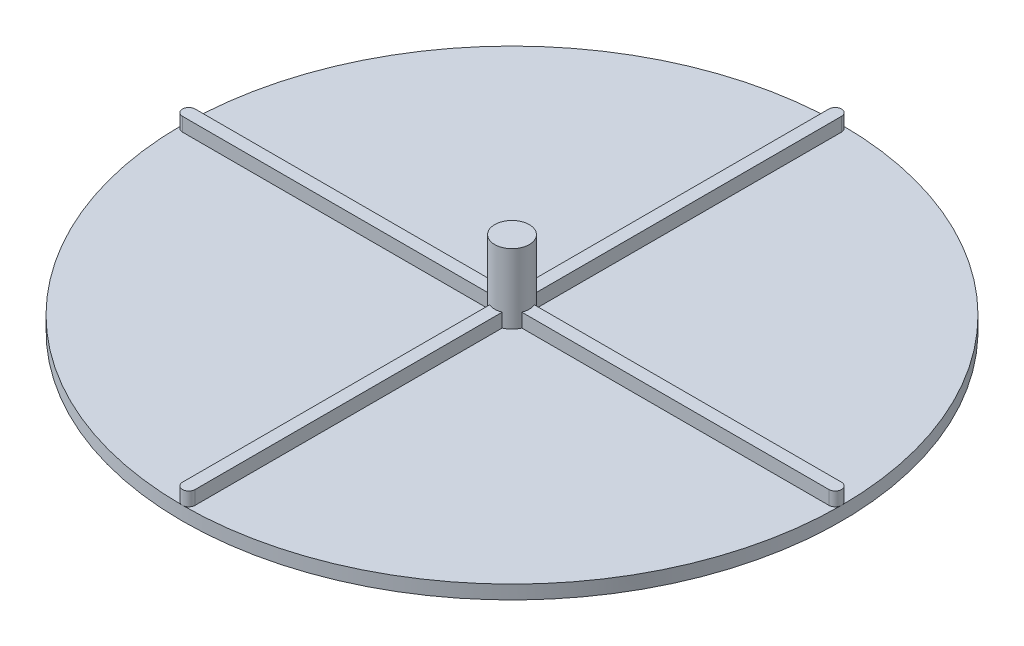
ISO-10303-21;
HEADER;
FILE_DESCRIPTION(('STEP AP214'),'2;1');
FILE_NAME('part.step','',(''),(''),'','','');
FILE_SCHEMA(('AUTOMOTIVE_DESIGN { 1 0 10303 214 1 1 1 1 }'));
ENDSEC;
DATA;
#1=APPLICATION_CONTEXT('core data for automotive mechanical design processes');
#2=APPLICATION_PROTOCOL_DEFINITION('international standard','automotive_design',2000,#1);
#3=PRODUCT_CONTEXT('',#1,'mechanical');
#4=PRODUCT('Part','Part','',(#3));
#5=PRODUCT_RELATED_PRODUCT_CATEGORY('part','',(#4));
#6=PRODUCT_DEFINITION_FORMATION('','',#4);
#7=PRODUCT_DEFINITION_CONTEXT('part definition',#1,'design');
#8=PRODUCT_DEFINITION('design','',#6,#7);
#9=PRODUCT_DEFINITION_SHAPE('','',#8);
#10=(LENGTH_UNIT() NAMED_UNIT(*) SI_UNIT(.MILLI.,.METRE.));
#11=(NAMED_UNIT(*) PLANE_ANGLE_UNIT() SI_UNIT($,.RADIAN.));
#12=(NAMED_UNIT(*) SI_UNIT($,.STERADIAN.) SOLID_ANGLE_UNIT());
#13=UNCERTAINTY_MEASURE_WITH_UNIT(LENGTH_MEASURE(1.E-05),#10,'distance_accuracy_value','');
#14=(GEOMETRIC_REPRESENTATION_CONTEXT(3) GLOBAL_UNCERTAINTY_ASSIGNED_CONTEXT((#13)) GLOBAL_UNIT_ASSIGNED_CONTEXT((#10,
#11,#12)) REPRESENTATION_CONTEXT('',''));
#15=CARTESIAN_POINT('',(0.,0.,0.));
#16=DIRECTION('',(0.,0.,1.));
#17=DIRECTION('',(1.,0.,0.));
#18=AXIS2_PLACEMENT_3D('',#15,#16,#17);
#19=CARTESIAN_POINT('',(0.,6.35,-74.7395));
#20=DIRECTION('',(0.,1.,0.));
#21=DIRECTION('',(0.,0.,1.));
#22=AXIS2_PLACEMENT_3D('',#19,#20,#21);
#23=PLANE('',#22);
#24=CARTESIAN_POINT('',(0.,6.35,0.));
#25=DIRECTION('',(0.,1.,0.));
#26=DIRECTION('',(0.,0.,1.));
#27=AXIS2_PLACEMENT_3D('',#24,#25,#26);
#28=CIRCLE('',#27,4.);
#29=CARTESIAN_POINT('',(3.72383401214393,6.35,1.4605));
#30=VERTEX_POINT('',#29);
#31=CARTESIAN_POINT('',(3.72383401214393,6.35,-1.4605));
#32=VERTEX_POINT('',#31);
#33=EDGE_CURVE('E222',#30,#32,#28,.T.);
#34=ORIENTED_EDGE('',*,*,#33,.F.);
#35=DIRECTION('',(1.,0.,0.));
#36=VECTOR('',#35,1.);
#37=CARTESIAN_POINT('',(-74.7395,6.35,1.4605));
#38=LINE('',#37,#36);
#39=CARTESIAN_POINT('',(74.7395,6.35,1.4605));
#40=VERTEX_POINT('',#39);
#41=EDGE_CURVE('E324',#30,#40,#38,.T.);
#42=ORIENTED_EDGE('',*,*,#41,.T.);
#43=CARTESIAN_POINT('',(74.7395,6.35,0.));
#44=DIRECTION('',(0.,1.,0.));
#45=DIRECTION('',(0.,0.,1.));
#46=AXIS2_PLACEMENT_3D('',#43,#44,#45);
#47=CIRCLE('',#46,1.4605);
#48=CARTESIAN_POINT('',(74.7395,6.35,-1.4605));
#49=VERTEX_POINT('',#48);
#50=EDGE_CURVE('E317',#40,#49,#47,.T.);
#51=ORIENTED_EDGE('',*,*,#50,.T.);
#52=DIRECTION('',(1.,0.,0.));
#53=VECTOR('',#52,1.);
#54=CARTESIAN_POINT('',(-74.7395,6.35,-1.4605));
#55=LINE('',#54,#53);
#56=EDGE_CURVE('E207',#32,#49,#55,.T.);
#57=ORIENTED_EDGE('',*,*,#56,.F.);
#58=EDGE_LOOP('',(#34,#42,#51,#57));
#59=FACE_BOUND('',#58,.T.);
#60=ADVANCED_FACE('F69',(#59),#23,.T.);
#61=CARTESIAN_POINT('',(1.46050000000002,6.35,-3.72383401214393));
#62=VERTEX_POINT('',#61);
#63=CARTESIAN_POINT('',(-1.46049999999998,6.35,-3.72383401214394));
#64=VERTEX_POINT('',#63);
#65=EDGE_CURVE('E221',#62,#64,#28,.T.);
#66=ORIENTED_EDGE('',*,*,#65,.F.);
#67=DIRECTION('',(0.,0.,1.));
#68=VECTOR('',#67,1.);
#69=CARTESIAN_POINT('',(1.46050000000002,6.35,-74.7395));
#70=LINE('',#69,#68);
#71=CARTESIAN_POINT('',(1.46050000000002,6.35,-74.7395));
#72=VERTEX_POINT('',#71);
#73=EDGE_CURVE('E277',#72,#62,#70,.T.);
#74=ORIENTED_EDGE('',*,*,#73,.F.);
#75=CARTESIAN_POINT('',(0.,6.35,-74.7395));
#76=DIRECTION('',(0.,1.,0.));
#77=DIRECTION('',(0.,0.,1.));
#78=AXIS2_PLACEMENT_3D('',#75,#76,#77);
#79=CIRCLE('',#78,1.4605);
#80=CARTESIAN_POINT('',(-1.46049999999998,6.35,-74.7395));
#81=VERTEX_POINT('',#80);
#82=EDGE_CURVE('E262',#72,#81,#79,.T.);
#83=ORIENTED_EDGE('',*,*,#82,.T.);
#84=DIRECTION('',(0.,0.,1.));
#85=VECTOR('',#84,1.);
#86=CARTESIAN_POINT('',(-1.46049999999998,6.35,-74.7395));
#87=LINE('',#86,#85);
#88=EDGE_CURVE('E268',#81,#64,#87,.T.);
#89=ORIENTED_EDGE('',*,*,#88,.T.);
#90=EDGE_LOOP('',(#66,#74,#83,#89));
#91=FACE_BOUND('',#90,.T.);
#92=ADVANCED_FACE('F456',(#91),#23,.T.);
#93=CARTESIAN_POINT('',(-3.72383401214394,6.35,-1.4605));
#94=VERTEX_POINT('',#93);
#95=CARTESIAN_POINT('',(-3.72383401214393,6.35,1.4605));
#96=VERTEX_POINT('',#95);
#97=EDGE_CURVE('E211',#94,#96,#28,.T.);
#98=ORIENTED_EDGE('',*,*,#97,.F.);
#99=CARTESIAN_POINT('',(-74.7395,6.35,-1.4605));
#100=VERTEX_POINT('',#99);
#101=EDGE_CURVE('E196',#100,#94,#55,.T.);
#102=ORIENTED_EDGE('',*,*,#101,.F.);
#103=CARTESIAN_POINT('',(-74.7395,6.35,0.));
#104=DIRECTION('',(0.,1.,0.));
#105=DIRECTION('',(0.,0.,1.));
#106=AXIS2_PLACEMENT_3D('',#103,#104,#105);
#107=CIRCLE('',#106,1.4605);
#108=CARTESIAN_POINT('',(-74.7395,6.35,1.4605));
#109=VERTEX_POINT('',#108);
#110=EDGE_CURVE('E206',#100,#109,#107,.T.);
#111=ORIENTED_EDGE('',*,*,#110,.T.);
#112=EDGE_CURVE('E214',#109,#96,#38,.T.);
#113=ORIENTED_EDGE('',*,*,#112,.T.);
#114=EDGE_LOOP('',(#98,#102,#111,#113));
#115=FACE_BOUND('',#114,.T.);
#116=ADVANCED_FACE('F212',(#115),#23,.T.);
#117=CARTESIAN_POINT('',(0.,3.175,0.));
#118=DIRECTION('',(0.,1.,0.));
#119=DIRECTION('',(0.,0.,1.));
#120=AXIS2_PLACEMENT_3D('',#117,#118,#119);
#121=PLANE('',#120);
#122=CARTESIAN_POINT('',(0.,3.175,0.));
#123=DIRECTION('',(0.,1.,0.));
#124=DIRECTION('',(0.,0.,1.));
#125=AXIS2_PLACEMENT_3D('',#122,#123,#124);
#126=CIRCLE('',#125,4.);
#127=CARTESIAN_POINT('',(3.72383401214393,3.175,1.4605));
#128=VERTEX_POINT('',#127);
#129=CARTESIAN_POINT('',(1.46050000000002,3.175,3.72383401214393));
#130=VERTEX_POINT('',#129);
#131=EDGE_CURVE('E93',#128,#130,#126,.F.);
#132=ORIENTED_EDGE('',*,*,#131,.T.);
#133=DIRECTION('',(0.,0.,1.));
#134=VECTOR('',#133,1.);
#135=CARTESIAN_POINT('',(1.46050000000002,3.175,-74.7395));
#136=LINE('',#135,#134);
#137=CARTESIAN_POINT('',(1.46050000000002,3.175,74.7395));
#138=VERTEX_POINT('',#137);
#139=EDGE_CURVE('E296',#130,#138,#136,.T.);
#140=ORIENTED_EDGE('',*,*,#139,.T.);
#141=CARTESIAN_POINT('',(0.,3.175,74.7395));
#142=DIRECTION('',(0.,1.,0.));
#143=DIRECTION('',(0.,0.,1.));
#144=AXIS2_PLACEMENT_3D('',#141,#142,#143);
#145=CIRCLE('',#144,1.4605);
#146=CARTESIAN_POINT('',(0.,3.175,76.2));
#147=VERTEX_POINT('',#146);
#148=EDGE_CURVE('E297',#147,#138,#145,.T.);
#149=ORIENTED_EDGE('',*,*,#148,.F.);
#150=CARTESIAN_POINT('',(0.,3.175,0.));
#151=DIRECTION('',(0.,1.,0.));
#152=DIRECTION('',(0.,0.,1.));
#153=AXIS2_PLACEMENT_3D('',#150,#151,#152);
#154=CIRCLE('',#153,76.2);
#155=CARTESIAN_POINT('',(76.2,3.175,0.));
#156=VERTEX_POINT('',#155);
#157=EDGE_CURVE('E356',#147,#156,#154,.T.);
#158=ORIENTED_EDGE('',*,*,#157,.T.);
#159=CARTESIAN_POINT('',(74.7395,3.175,0.));
#160=DIRECTION('',(0.,1.,0.));
#161=DIRECTION('',(0.,0.,1.));
#162=AXIS2_PLACEMENT_3D('',#159,#160,#161);
#163=CIRCLE('',#162,1.4605);
#164=CARTESIAN_POINT('',(74.7395,3.175,1.4605));
#165=VERTEX_POINT('',#164);
#166=EDGE_CURVE('E261',#165,#156,#163,.T.);
#167=ORIENTED_EDGE('',*,*,#166,.F.);
#168=DIRECTION('',(1.,0.,0.));
#169=VECTOR('',#168,1.);
#170=CARTESIAN_POINT('',(-74.7395,3.175,1.4605));
#171=LINE('',#170,#169);
#172=EDGE_CURVE('E339',#128,#165,#171,.T.);
#173=ORIENTED_EDGE('',*,*,#172,.F.);
#174=EDGE_LOOP('',(#132,#140,#149,#158,#167,#173));
#175=FACE_BOUND('',#174,.T.);
#176=ADVANCED_FACE('F444',(#175),#121,.T.);
#177=CARTESIAN_POINT('',(1.46050000000002,3.175,-3.72383401214393));
#178=VERTEX_POINT('',#177);
#179=CARTESIAN_POINT('',(3.72383401214393,3.175,-1.4605));
#180=VERTEX_POINT('',#179);
#181=EDGE_CURVE('E232',#178,#180,#126,.F.);
#182=ORIENTED_EDGE('',*,*,#181,.T.);
#183=DIRECTION('',(1.,0.,0.));
#184=VECTOR('',#183,1.);
#185=CARTESIAN_POINT('',(-74.7395,3.175,-1.4605));
#186=LINE('',#185,#184);
#187=CARTESIAN_POINT('',(74.7395,3.175,-1.4605));
#188=VERTEX_POINT('',#187);
#189=EDGE_CURVE('E331',#180,#188,#186,.T.);
#190=ORIENTED_EDGE('',*,*,#189,.T.);
#191=EDGE_CURVE('E78',#156,#188,#163,.T.);
#192=ORIENTED_EDGE('',*,*,#191,.F.);
#193=CARTESIAN_POINT('',(0.,3.175,-76.2));
#194=VERTEX_POINT('',#193);
#195=EDGE_CURVE('E359',#156,#194,#154,.T.);
#196=ORIENTED_EDGE('',*,*,#195,.T.);
#197=CARTESIAN_POINT('',(0.,3.175,-74.7395));
#198=DIRECTION('',(0.,1.,0.));
#199=DIRECTION('',(0.,0.,1.));
#200=AXIS2_PLACEMENT_3D('',#197,#198,#199);
#201=CIRCLE('',#200,1.4605);
#202=CARTESIAN_POINT('',(1.46050000000002,3.175,-74.7395));
#203=VERTEX_POINT('',#202);
#204=EDGE_CURVE('E282',#203,#194,#201,.T.);
#205=ORIENTED_EDGE('',*,*,#204,.F.);
#206=EDGE_CURVE('E267',#203,#178,#136,.T.);
#207=ORIENTED_EDGE('',*,*,#206,.T.);
#208=EDGE_LOOP('',(#182,#190,#192,#196,#205,#207));
#209=FACE_BOUND('',#208,.T.);
#210=ADVANCED_FACE('F379',(#209),#121,.T.);
#211=CARTESIAN_POINT('',(-1.46049999999998,3.175,3.72383401214395));
#212=VERTEX_POINT('',#211);
#213=CARTESIAN_POINT('',(-3.72383401214393,3.175,1.4605));
#214=VERTEX_POINT('',#213);
#215=EDGE_CURVE('E219',#212,#214,#126,.F.);
#216=ORIENTED_EDGE('',*,*,#215,.T.);
#217=CARTESIAN_POINT('',(-74.7395,3.175,1.4605));
#218=VERTEX_POINT('',#217);
#219=EDGE_CURVE('E320',#218,#214,#171,.T.);
#220=ORIENTED_EDGE('',*,*,#219,.F.);
#221=CARTESIAN_POINT('',(-74.7395,3.175,0.));
#222=DIRECTION('',(0.,1.,0.));
#223=DIRECTION('',(0.,0.,1.));
#224=AXIS2_PLACEMENT_3D('',#221,#222,#223);
#225=CIRCLE('',#224,1.4605);
#226=CARTESIAN_POINT('',(-76.2,3.175,0.));
#227=VERTEX_POINT('',#226);
#228=EDGE_CURVE('E340',#227,#218,#225,.T.);
#229=ORIENTED_EDGE('',*,*,#228,.F.);
#230=EDGE_CURVE('E360',#227,#147,#154,.T.);
#231=ORIENTED_EDGE('',*,*,#230,.T.);
#232=CARTESIAN_POINT('',(-1.46049999999998,3.175,74.7395));
#233=VERTEX_POINT('',#232);
#234=EDGE_CURVE('E292',#233,#147,#145,.T.);
#235=ORIENTED_EDGE('',*,*,#234,.F.);
#236=DIRECTION('',(0.,0.,1.));
#237=VECTOR('',#236,1.);
#238=CARTESIAN_POINT('',(-1.46049999999998,3.175,-74.7395));
#239=LINE('',#238,#237);
#240=EDGE_CURVE('E286',#212,#233,#239,.T.);
#241=ORIENTED_EDGE('',*,*,#240,.F.);
#242=EDGE_LOOP('',(#216,#220,#229,#231,#235,#241));
#243=FACE_BOUND('',#242,.T.);
#244=ADVANCED_FACE('F439',(#243),#121,.T.);
#245=CARTESIAN_POINT('',(0.,3.175,0.));
#246=DIRECTION('',(0.,-1.,0.));
#247=DIRECTION('',(0.,0.,-1.));
#248=AXIS2_PLACEMENT_3D('',#245,#246,#247);
#249=CYLINDRICAL_SURFACE('',#248,76.2);
#250=ORIENTED_EDGE('',*,*,#157,.F.);
#251=ORIENTED_EDGE('',*,*,#230,.F.);
#252=EDGE_CURVE('E367',#194,#227,#154,.T.);
#253=ORIENTED_EDGE('',*,*,#252,.F.);
#254=ORIENTED_EDGE('',*,*,#195,.F.);
#255=EDGE_LOOP('',(#250,#251,#253,#254));
#256=FACE_BOUND('',#255,.T.);
#257=CARTESIAN_POINT('',(0.,0.,0.));
#258=DIRECTION('',(0.,1.,0.));
#259=DIRECTION('',(0.,0.,1.));
#260=AXIS2_PLACEMENT_3D('',#257,#258,#259);
#261=CIRCLE('',#260,76.2);
#262=CARTESIAN_POINT('',(0.,0.,76.2));
#263=VERTEX_POINT('',#262);
#264=EDGE_CURVE('E316',#263,#263,#261,.T.);
#265=ORIENTED_EDGE('',*,*,#264,.T.);
#266=EDGE_LOOP('',(#265));
#267=FACE_BOUND('',#266,.T.);
#268=ADVANCED_FACE('F71',(#256,#267),#249,.T.);
#269=CARTESIAN_POINT('',(-3.72383401214393,3.175,-1.4605));
#270=VERTEX_POINT('',#269);
#271=CARTESIAN_POINT('',(-1.46049999999998,3.175,-3.72383401214395));
#272=VERTEX_POINT('',#271);
#273=EDGE_CURVE('E226',#270,#272,#126,.F.);
#274=ORIENTED_EDGE('',*,*,#273,.T.);
#275=CARTESIAN_POINT('',(-1.46049999999998,3.175,-74.7395));
#276=VERTEX_POINT('',#275);
#277=EDGE_CURVE('E289',#276,#272,#239,.T.);
#278=ORIENTED_EDGE('',*,*,#277,.F.);
#279=EDGE_CURVE('E288',#194,#276,#201,.T.);
#280=ORIENTED_EDGE('',*,*,#279,.F.);
#281=ORIENTED_EDGE('',*,*,#252,.T.);
#282=CARTESIAN_POINT('',(-74.7395,3.175,-1.4605));
#283=VERTEX_POINT('',#282);
#284=EDGE_CURVE('E335',#283,#227,#225,.T.);
#285=ORIENTED_EDGE('',*,*,#284,.F.);
#286=EDGE_CURVE('E332',#283,#270,#186,.T.);
#287=ORIENTED_EDGE('',*,*,#286,.T.);
#288=EDGE_LOOP('',(#274,#278,#280,#281,#285,#287));
#289=FACE_BOUND('',#288,.T.);
#290=ADVANCED_FACE('F446',(#289),#121,.T.);
#291=CARTESIAN_POINT('',(0.,0.,0.));
#292=DIRECTION('',(0.,1.,0.));
#293=DIRECTION('',(0.,0.,1.));
#294=AXIS2_PLACEMENT_3D('',#291,#292,#293);
#295=PLANE('',#294);
#296=ORIENTED_EDGE('',*,*,#264,.F.);
#297=EDGE_LOOP('',(#296));
#298=FACE_BOUND('',#297,.T.);
#299=ADVANCED_FACE('F452',(#298),#295,.F.);
#300=CARTESIAN_POINT('',(-1.46049999999998,6.35,-74.7395));
#301=DIRECTION('',(1.,0.,0.));
#302=DIRECTION('',(0.,0.,-1.));
#303=AXIS2_PLACEMENT_3D('',#300,#301,#302);
#304=PLANE('',#303);
#305=CARTESIAN_POINT('',(-1.46049999999998,6.35,3.72383401214394));
#306=VERTEX_POINT('',#305);
#307=CARTESIAN_POINT('',(-1.46049999999998,6.35,74.7395));
#308=VERTEX_POINT('',#307);
#309=EDGE_CURVE('E266',#306,#308,#87,.T.);
#310=ORIENTED_EDGE('',*,*,#309,.F.);
#311=DIRECTION('',(0.,1.,0.));
#312=VECTOR('',#311,1.);
#313=CARTESIAN_POINT('',(-1.46049999999998,-8.13870849898476,3.72383401214394));
#314=LINE('',#313,#312);
#315=EDGE_CURVE('E85',#306,#212,#314,.F.);
#316=ORIENTED_EDGE('',*,*,#315,.T.);
#317=ORIENTED_EDGE('',*,*,#240,.T.);
#318=DIRECTION('',(0.,-1.,0.));
#319=VECTOR('',#318,1.);
#320=CARTESIAN_POINT('',(-1.46049999999998,6.35,74.7395));
#321=LINE('',#320,#319);
#322=EDGE_CURVE('E308',#308,#233,#321,.T.);
#323=ORIENTED_EDGE('',*,*,#322,.F.);
#324=EDGE_LOOP('',(#310,#316,#317,#323));
#325=FACE_BOUND('',#324,.T.);
#326=ADVANCED_FACE('F414',(#325),#304,.F.);
#327=CARTESIAN_POINT('',(0.,6.35,74.7395));
#328=DIRECTION('',(0.,-1.,0.));
#329=DIRECTION('',(0.,0.,-1.));
#330=AXIS2_PLACEMENT_3D('',#327,#328,#329);
#331=CYLINDRICAL_SURFACE('',#330,1.4605);
#332=ORIENTED_EDGE('',*,*,#234,.T.);
#333=ORIENTED_EDGE('',*,*,#148,.T.);
#334=DIRECTION('',(0.,-1.,0.));
#335=VECTOR('',#334,1.);
#336=CARTESIAN_POINT('',(1.46050000000002,6.35,74.7395));
#337=LINE('',#336,#335);
#338=CARTESIAN_POINT('',(1.46050000000002,6.35,74.7395));
#339=VERTEX_POINT('',#338);
#340=EDGE_CURVE('E304',#339,#138,#337,.T.);
#341=ORIENTED_EDGE('',*,*,#340,.F.);
#342=CARTESIAN_POINT('',(0.,6.35,74.7395));
#343=DIRECTION('',(0.,1.,0.));
#344=DIRECTION('',(0.,0.,1.));
#345=AXIS2_PLACEMENT_3D('',#342,#343,#344);
#346=CIRCLE('',#345,1.4605);
#347=EDGE_CURVE('E272',#308,#339,#346,.T.);
#348=ORIENTED_EDGE('',*,*,#347,.F.);
#349=ORIENTED_EDGE('',*,*,#322,.T.);
#350=EDGE_LOOP('',(#332,#333,#341,#348,#349));
#351=FACE_BOUND('',#350,.T.);
#352=ADVANCED_FACE('F440',(#351),#331,.T.);
#353=CARTESIAN_POINT('',(1.46050000000002,6.35,-74.7395));
#354=DIRECTION('',(1.,0.,0.));
#355=DIRECTION('',(0.,0.,-1.));
#356=AXIS2_PLACEMENT_3D('',#353,#354,#355);
#357=PLANE('',#356);
#358=DIRECTION('',(0.,1.,0.));
#359=VECTOR('',#358,1.);
#360=CARTESIAN_POINT('',(1.46050000000002,-8.13870849898476,3.72383401214393));
#361=LINE('',#360,#359);
#362=CARTESIAN_POINT('',(1.46050000000002,6.35,3.72383401214393));
#363=VERTEX_POINT('',#362);
#364=EDGE_CURVE('E249',#363,#130,#361,.F.);
#365=ORIENTED_EDGE('',*,*,#364,.F.);
#366=EDGE_CURVE('E276',#363,#339,#70,.T.);
#367=ORIENTED_EDGE('',*,*,#366,.T.);
#368=ORIENTED_EDGE('',*,*,#340,.T.);
#369=ORIENTED_EDGE('',*,*,#139,.F.);
#370=EDGE_LOOP('',(#365,#367,#368,#369));
#371=FACE_BOUND('',#370,.T.);
#372=ADVANCED_FACE('F442',(#371),#357,.T.);
#373=CARTESIAN_POINT('',(0.,6.35,-74.7395));
#374=DIRECTION('',(0.,-1.,0.));
#375=DIRECTION('',(0.,0.,-1.));
#376=AXIS2_PLACEMENT_3D('',#373,#374,#375);
#377=CYLINDRICAL_SURFACE('',#376,1.4605);
#378=ORIENTED_EDGE('',*,*,#204,.T.);
#379=ORIENTED_EDGE('',*,*,#279,.T.);
#380=DIRECTION('',(0.,-1.,0.));
#381=VECTOR('',#380,1.);
#382=CARTESIAN_POINT('',(-1.46049999999998,6.35,-74.7395));
#383=LINE('',#382,#381);
#384=EDGE_CURVE('E312',#81,#276,#383,.T.);
#385=ORIENTED_EDGE('',*,*,#384,.F.);
#386=ORIENTED_EDGE('',*,*,#82,.F.);
#387=DIRECTION('',(0.,-1.,0.));
#388=VECTOR('',#387,1.);
#389=CARTESIAN_POINT('',(1.46050000000002,6.35,-74.7395));
#390=LINE('',#389,#388);
#391=EDGE_CURVE('E281',#72,#203,#390,.T.);
#392=ORIENTED_EDGE('',*,*,#391,.T.);
#393=EDGE_LOOP('',(#378,#379,#385,#386,#392));
#394=FACE_BOUND('',#393,.T.);
#395=ADVANCED_FACE('F384',(#394),#377,.T.);
#396=ORIENTED_EDGE('',*,*,#277,.T.);
#397=DIRECTION('',(0.,1.,0.));
#398=VECTOR('',#397,1.);
#399=CARTESIAN_POINT('',(-1.46049999999998,-8.13870849898476,-3.72383401214394));
#400=LINE('',#399,#398);
#401=EDGE_CURVE('E228',#272,#64,#400,.T.);
#402=ORIENTED_EDGE('',*,*,#401,.T.);
#403=ORIENTED_EDGE('',*,*,#88,.F.);
#404=ORIENTED_EDGE('',*,*,#384,.T.);
#405=EDGE_LOOP('',(#396,#402,#403,#404));
#406=FACE_BOUND('',#405,.T.);
#407=ADVANCED_FACE('F471',(#406),#304,.F.);
#408=DIRECTION('',(0.,1.,0.));
#409=VECTOR('',#408,1.);
#410=CARTESIAN_POINT('',(1.46050000000002,-8.13870849898476,-3.72383401214393));
#411=LINE('',#410,#409);
#412=EDGE_CURVE('E255',#178,#62,#411,.T.);
#413=ORIENTED_EDGE('',*,*,#412,.F.);
#414=ORIENTED_EDGE('',*,*,#206,.F.);
#415=ORIENTED_EDGE('',*,*,#391,.F.);
#416=ORIENTED_EDGE('',*,*,#73,.T.);
#417=EDGE_LOOP('',(#413,#414,#415,#416));
#418=FACE_BOUND('',#417,.T.);
#419=ADVANCED_FACE('F390',(#418),#357,.T.);
#420=EDGE_CURVE('E248',#306,#363,#28,.T.);
#421=ORIENTED_EDGE('',*,*,#420,.F.);
#422=ORIENTED_EDGE('',*,*,#309,.T.);
#423=ORIENTED_EDGE('',*,*,#347,.T.);
#424=ORIENTED_EDGE('',*,*,#366,.F.);
#425=EDGE_LOOP('',(#421,#422,#423,#424));
#426=FACE_BOUND('',#425,.T.);
#427=ADVANCED_FACE('F412',(#426),#23,.T.);
#428=CARTESIAN_POINT('',(-74.7395,6.35,1.4605));
#429=DIRECTION('',(0.,0.,-1.));
#430=DIRECTION('',(-1.,0.,0.));
#431=AXIS2_PLACEMENT_3D('',#428,#429,#430);
#432=PLANE('',#431);
#433=ORIENTED_EDGE('',*,*,#41,.F.);
#434=DIRECTION('',(0.,1.,0.));
#435=VECTOR('',#434,1.);
#436=CARTESIAN_POINT('',(3.72383401214394,-8.13870849898476,1.4605));
#437=LINE('',#436,#435);
#438=EDGE_CURVE('E245',#30,#128,#437,.F.);
#439=ORIENTED_EDGE('',*,*,#438,.T.);
#440=ORIENTED_EDGE('',*,*,#172,.T.);
#441=DIRECTION('',(0.,-1.,0.));
#442=VECTOR('',#441,1.);
#443=CARTESIAN_POINT('',(74.7395,6.35,1.4605));
#444=LINE('',#443,#442);
#445=EDGE_CURVE('E327',#40,#165,#444,.T.);
#446=ORIENTED_EDGE('',*,*,#445,.F.);
#447=EDGE_LOOP('',(#433,#439,#440,#446));
#448=FACE_BOUND('',#447,.T.);
#449=ADVANCED_FACE('F422',(#448),#432,.F.);
#450=CARTESIAN_POINT('',(74.7395,6.35,0.));
#451=DIRECTION('',(0.,-1.,0.));
#452=DIRECTION('',(0.,0.,-1.));
#453=AXIS2_PLACEMENT_3D('',#450,#451,#452);
#454=CYLINDRICAL_SURFACE('',#453,1.4605);
#455=ORIENTED_EDGE('',*,*,#166,.T.);
#456=ORIENTED_EDGE('',*,*,#191,.T.);
#457=DIRECTION('',(0.,-1.,0.));
#458=VECTOR('',#457,1.);
#459=CARTESIAN_POINT('',(74.7395,6.35,-1.4605));
#460=LINE('',#459,#458);
#461=EDGE_CURVE('E287',#49,#188,#460,.T.);
#462=ORIENTED_EDGE('',*,*,#461,.F.);
#463=ORIENTED_EDGE('',*,*,#50,.F.);
#464=ORIENTED_EDGE('',*,*,#445,.T.);
#465=EDGE_LOOP('',(#455,#456,#462,#463,#464));
#466=FACE_BOUND('',#465,.T.);
#467=ADVANCED_FACE('F425',(#466),#454,.T.);
#468=CARTESIAN_POINT('',(-74.7395,6.35,-1.4605));
#469=DIRECTION('',(0.,0.,-1.));
#470=DIRECTION('',(-1.,0.,0.));
#471=AXIS2_PLACEMENT_3D('',#468,#469,#470);
#472=PLANE('',#471);
#473=DIRECTION('',(0.,1.,0.));
#474=VECTOR('',#473,1.);
#475=CARTESIAN_POINT('',(3.72383401214394,-8.13870849898476,-1.4605));
#476=LINE('',#475,#474);
#477=EDGE_CURVE('E241',#32,#180,#476,.F.);
#478=ORIENTED_EDGE('',*,*,#477,.F.);
#479=ORIENTED_EDGE('',*,*,#56,.T.);
#480=ORIENTED_EDGE('',*,*,#461,.T.);
#481=ORIENTED_EDGE('',*,*,#189,.F.);
#482=EDGE_LOOP('',(#478,#479,#480,#481));
#483=FACE_BOUND('',#482,.T.);
#484=ADVANCED_FACE('F397',(#483),#472,.T.);
#485=CARTESIAN_POINT('',(-74.7395,6.35,0.));
#486=DIRECTION('',(0.,-1.,0.));
#487=DIRECTION('',(0.,0.,-1.));
#488=AXIS2_PLACEMENT_3D('',#485,#486,#487);
#489=CYLINDRICAL_SURFACE('',#488,1.4605);
#490=ORIENTED_EDGE('',*,*,#284,.T.);
#491=ORIENTED_EDGE('',*,*,#228,.T.);
#492=DIRECTION('',(0.,-1.,0.));
#493=VECTOR('',#492,1.);
#494=CARTESIAN_POINT('',(-74.7395,6.35,1.4605));
#495=LINE('',#494,#493);
#496=EDGE_CURVE('E347',#109,#218,#495,.T.);
#497=ORIENTED_EDGE('',*,*,#496,.F.);
#498=ORIENTED_EDGE('',*,*,#110,.F.);
#499=DIRECTION('',(0.,-1.,0.));
#500=VECTOR('',#499,1.);
#501=CARTESIAN_POINT('',(-74.7395,6.35,-1.4605));
#502=LINE('',#501,#500);
#503=EDGE_CURVE('E202',#100,#283,#502,.T.);
#504=ORIENTED_EDGE('',*,*,#503,.T.);
#505=EDGE_LOOP('',(#490,#491,#497,#498,#504));
#506=FACE_BOUND('',#505,.T.);
#507=ADVANCED_FACE('F436',(#506),#489,.T.);
#508=ORIENTED_EDGE('',*,*,#219,.T.);
#509=DIRECTION('',(0.,1.,0.));
#510=VECTOR('',#509,1.);
#511=CARTESIAN_POINT('',(-3.72383401214394,-8.13870849898476,1.4605));
#512=LINE('',#511,#510);
#513=EDGE_CURVE('E218',#214,#96,#512,.T.);
#514=ORIENTED_EDGE('',*,*,#513,.T.);
#515=ORIENTED_EDGE('',*,*,#112,.F.);
#516=ORIENTED_EDGE('',*,*,#496,.T.);
#517=EDGE_LOOP('',(#508,#514,#515,#516));
#518=FACE_BOUND('',#517,.T.);
#519=ADVANCED_FACE('F438',(#518),#432,.F.);
#520=DIRECTION('',(0.,1.,0.));
#521=VECTOR('',#520,1.);
#522=CARTESIAN_POINT('',(-3.72383401214394,-8.13870849898476,-1.4605));
#523=LINE('',#522,#521);
#524=EDGE_CURVE('E12',#270,#94,#523,.T.);
#525=ORIENTED_EDGE('',*,*,#524,.F.);
#526=ORIENTED_EDGE('',*,*,#286,.F.);
#527=ORIENTED_EDGE('',*,*,#503,.F.);
#528=ORIENTED_EDGE('',*,*,#101,.T.);
#529=EDGE_LOOP('',(#525,#526,#527,#528));
#530=FACE_BOUND('',#529,.T.);
#531=ADVANCED_FACE('F198',(#530),#472,.T.);
#532=CARTESIAN_POINT('',(0.,-8.13870849898476,0.));
#533=DIRECTION('',(0.,1.,0.));
#534=DIRECTION('',(0.,0.,1.));
#535=AXIS2_PLACEMENT_3D('',#532,#533,#534);
#536=CYLINDRICAL_SURFACE('',#535,4.);
#537=CARTESIAN_POINT('',(0.,19.304,0.));
#538=DIRECTION('',(0.,1.,0.));
#539=DIRECTION('',(0.,0.,1.));
#540=AXIS2_PLACEMENT_3D('',#537,#538,#539);
#541=CIRCLE('',#540,4.);
#542=CARTESIAN_POINT('',(0.,19.304,4.));
#543=VERTEX_POINT('',#542);
#544=EDGE_CURVE('E237',#543,#543,#541,.T.);
#545=ORIENTED_EDGE('',*,*,#544,.F.);
#546=EDGE_LOOP('',(#545));
#547=FACE_BOUND('',#546,.T.);
#548=ORIENTED_EDGE('',*,*,#401,.F.);
#549=ORIENTED_EDGE('',*,*,#273,.F.);
#550=ORIENTED_EDGE('',*,*,#524,.T.);
#551=ORIENTED_EDGE('',*,*,#97,.T.);
#552=ORIENTED_EDGE('',*,*,#513,.F.);
#553=ORIENTED_EDGE('',*,*,#215,.F.);
#554=ORIENTED_EDGE('',*,*,#315,.F.);
#555=ORIENTED_EDGE('',*,*,#420,.T.);
#556=ORIENTED_EDGE('',*,*,#364,.T.);
#557=ORIENTED_EDGE('',*,*,#131,.F.);
#558=ORIENTED_EDGE('',*,*,#438,.F.);
#559=ORIENTED_EDGE('',*,*,#33,.T.);
#560=ORIENTED_EDGE('',*,*,#477,.T.);
#561=ORIENTED_EDGE('',*,*,#181,.F.);
#562=ORIENTED_EDGE('',*,*,#412,.T.);
#563=ORIENTED_EDGE('',*,*,#65,.T.);
#564=EDGE_LOOP('',(#548,#549,#550,#551,#552,#553,#554,#555,#556,#557,#558,#559,#560,#561,#562,#563));
#565=FACE_BOUND('',#564,.T.);
#566=ADVANCED_FACE('F225',(#547,#565),#536,.T.);
#567=CARTESIAN_POINT('',(0.,19.304,0.));
#568=DIRECTION('',(0.,1.,0.));
#569=DIRECTION('',(0.,0.,1.));
#570=AXIS2_PLACEMENT_3D('',#567,#568,#569);
#571=PLANE('',#570);
#572=ORIENTED_EDGE('',*,*,#544,.T.);
#573=EDGE_LOOP('',(#572));
#574=FACE_BOUND('',#573,.T.);
#575=ADVANCED_FACE('F508',(#574),#571,.T.);
#576=CLOSED_SHELL('',(#60,#92,#116,#176,#210,#244,#268,#290,#299,#326,#352,#372,#395,#407,#419,
#427,#449,#467,#484,#507,#519,#531,#566,#575));
#577=MANIFOLD_SOLID_BREP('B2',#576);
#578=ADVANCED_BREP_SHAPE_REPRESENTATION('',(#18,#577),#14);
#579=SHAPE_DEFINITION_REPRESENTATION(#9,#578);
ENDSEC;
END-ISO-10303-21;
